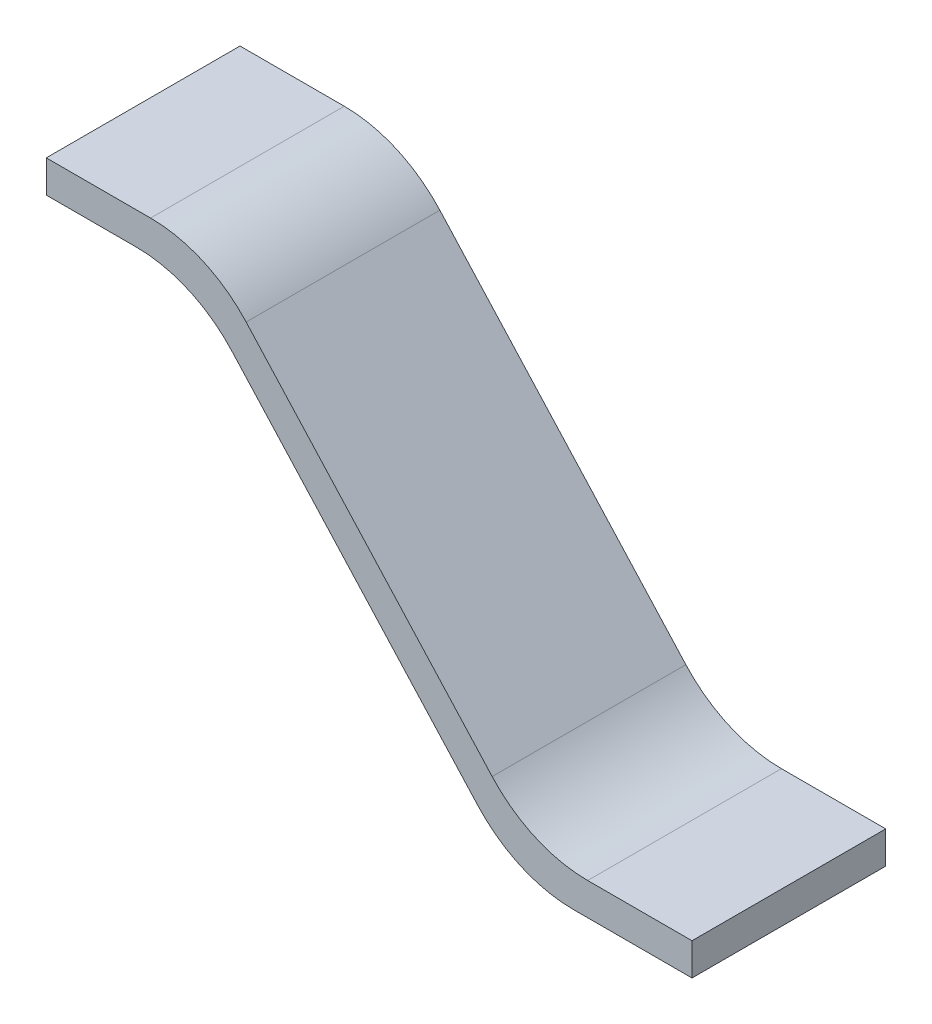
ISO-10303-21;
HEADER;
FILE_DESCRIPTION(('STEP AP214'),'2;1');
FILE_NAME('part.step','',(''),(''),'','','');
FILE_SCHEMA(('AUTOMOTIVE_DESIGN { 1 0 10303 214 1 1 1 1 }'));
ENDSEC;
DATA;
#1=APPLICATION_CONTEXT('core data for automotive mechanical design processes');
#2=APPLICATION_PROTOCOL_DEFINITION('international standard','automotive_design',2000,#1);
#3=PRODUCT_CONTEXT('',#1,'mechanical');
#4=PRODUCT('Part','Part','',(#3));
#5=PRODUCT_RELATED_PRODUCT_CATEGORY('part','',(#4));
#6=PRODUCT_DEFINITION_FORMATION('','',#4);
#7=PRODUCT_DEFINITION_CONTEXT('part definition',#1,'design');
#8=PRODUCT_DEFINITION('design','',#6,#7);
#9=PRODUCT_DEFINITION_SHAPE('','',#8);
#10=(LENGTH_UNIT() NAMED_UNIT(*) SI_UNIT(.MILLI.,.METRE.));
#11=(NAMED_UNIT(*) PLANE_ANGLE_UNIT() SI_UNIT($,.RADIAN.));
#12=(NAMED_UNIT(*) SI_UNIT($,.STERADIAN.) SOLID_ANGLE_UNIT());
#13=UNCERTAINTY_MEASURE_WITH_UNIT(LENGTH_MEASURE(1.E-05),#10,'distance_accuracy_value','');
#14=(GEOMETRIC_REPRESENTATION_CONTEXT(3) GLOBAL_UNCERTAINTY_ASSIGNED_CONTEXT((#13)) GLOBAL_UNIT_ASSIGNED_CONTEXT((#10,
#11,#12)) REPRESENTATION_CONTEXT('',''));
#15=CARTESIAN_POINT('',(0.,0.,0.));
#16=DIRECTION('',(0.,0.,1.));
#17=DIRECTION('',(1.,0.,0.));
#18=AXIS2_PLACEMENT_3D('',#15,#16,#17);
#19=CARTESIAN_POINT('',(0.,-0.05,0.15));
#20=DIRECTION('',(1.,0.,0.));
#21=DIRECTION('',(0.,0.,-1.));
#22=AXIS2_PLACEMENT_3D('',#19,#20,#21);
#23=PLANE('',#22);
#24=DIRECTION('',(0.,-1.,0.));
#25=VECTOR('',#24,1.);
#26=CARTESIAN_POINT('',(0.,-0.05,-0.15));
#27=LINE('',#26,#25);
#28=CARTESIAN_POINT('',(0.,0.,-0.15));
#29=VERTEX_POINT('',#28);
#30=CARTESIAN_POINT('',(0.,-0.05,-0.15));
#31=VERTEX_POINT('',#30);
#32=EDGE_CURVE('E148',#29,#31,#27,.T.);
#33=ORIENTED_EDGE('',*,*,#32,.T.);
#34=DIRECTION('',(0.,0.,-1.));
#35=VECTOR('',#34,1.);
#36=CARTESIAN_POINT('',(0.,-0.05,0.15));
#37=LINE('',#36,#35);
#38=CARTESIAN_POINT('',(0.,-0.05,0.15));
#39=VERTEX_POINT('',#38);
#40=EDGE_CURVE('E130',#39,#31,#37,.T.);
#41=ORIENTED_EDGE('',*,*,#40,.F.);
#42=DIRECTION('',(0.,-1.,0.));
#43=VECTOR('',#42,1.);
#44=CARTESIAN_POINT('',(0.,-0.05,0.15));
#45=LINE('',#44,#43);
#46=CARTESIAN_POINT('',(0.,0.,0.15));
#47=VERTEX_POINT('',#46);
#48=EDGE_CURVE('E136',#47,#39,#45,.T.);
#49=ORIENTED_EDGE('',*,*,#48,.F.);
#50=DIRECTION('',(0.,0.,-1.));
#51=VECTOR('',#50,1.);
#52=CARTESIAN_POINT('',(0.,0.,0.15));
#53=LINE('',#52,#51);
#54=EDGE_CURVE('E210',#47,#29,#53,.T.);
#55=ORIENTED_EDGE('',*,*,#54,.T.);
#56=EDGE_LOOP('',(#33,#41,#49,#55));
#57=FACE_BOUND('',#56,.T.);
#58=ADVANCED_FACE('F35',(#57),#23,.F.);
#59=CARTESIAN_POINT('',(0.,-0.05,0.15));
#60=DIRECTION('',(0.,1.,0.));
#61=DIRECTION('',(0.,0.,1.));
#62=AXIS2_PLACEMENT_3D('',#59,#60,#61);
#63=PLANE('',#62);
#64=DIRECTION('',(1.,0.,0.));
#65=VECTOR('',#64,1.);
#66=CARTESIAN_POINT('',(0.,-0.05,-0.15));
#67=LINE('',#66,#65);
#68=CARTESIAN_POINT('',(0.139407528470034,-0.05,-0.15));
#69=VERTEX_POINT('',#68);
#70=EDGE_CURVE('E217',#31,#69,#67,.T.);
#71=ORIENTED_EDGE('',*,*,#70,.T.);
#72=DIRECTION('',(0.,0.,-1.));
#73=VECTOR('',#72,1.);
#74=CARTESIAN_POINT('',(0.139407528470034,-0.05,0.15));
#75=LINE('',#74,#73);
#76=CARTESIAN_POINT('',(0.139407528470034,-0.05,0.15));
#77=VERTEX_POINT('',#76);
#78=EDGE_CURVE('E133',#69,#77,#75,.F.);
#79=ORIENTED_EDGE('',*,*,#78,.T.);
#80=DIRECTION('',(1.,0.,0.));
#81=VECTOR('',#80,1.);
#82=CARTESIAN_POINT('',(0.,-0.05,0.15));
#83=LINE('',#82,#81);
#84=EDGE_CURVE('E125',#39,#77,#83,.T.);
#85=ORIENTED_EDGE('',*,*,#84,.F.);
#86=ORIENTED_EDGE('',*,*,#40,.T.);
#87=EDGE_LOOP('',(#71,#79,#85,#86));
#88=FACE_BOUND('',#87,.T.);
#89=ADVANCED_FACE('F128',(#88),#63,.F.);
#90=CARTESIAN_POINT('',(0.227881505694007,-0.05,0.15));
#91=DIRECTION('',(0.739940073395944,0.672672793996313,0.));
#92=DIRECTION('',(-0.672672793996313,0.739940073395944,0.));
#93=AXIS2_PLACEMENT_3D('',#90,#91,#92);
#94=PLANE('',#93);
#95=DIRECTION('',(0.672672793996313,-0.739940073395944,0.));
#96=VECTOR('',#95,1.);
#97=CARTESIAN_POINT('',(0.227881505694007,-0.05,0.15));
#98=LINE('',#97,#96);
#99=CARTESIAN_POINT('',(0.287395543149223,-0.115465441200738,0.15));
#100=VERTEX_POINT('',#99);
#101=CARTESIAN_POINT('',(0.668367468238791,-0.534534558799262,0.15));
#102=VERTEX_POINT('',#101);
#103=EDGE_CURVE('E135',#100,#102,#98,.T.);
#104=ORIENTED_EDGE('',*,*,#103,.F.);
#105=DIRECTION('',(0.,0.,-1.));
#106=VECTOR('',#105,1.);
#107=CARTESIAN_POINT('',(0.287395543149223,-0.115465441200738,-0.15));
#108=LINE('',#107,#106);
#109=CARTESIAN_POINT('',(0.287395543149223,-0.115465441200738,-0.15));
#110=VERTEX_POINT('',#109);
#111=EDGE_CURVE('E152',#100,#110,#108,.T.);
#112=ORIENTED_EDGE('',*,*,#111,.T.);
#113=DIRECTION('',(0.672672793996313,-0.739940073395944,0.));
#114=VECTOR('',#113,1.);
#115=CARTESIAN_POINT('',(0.227881505694007,-0.05,-0.15));
#116=LINE('',#115,#114);
#117=CARTESIAN_POINT('',(0.668367468238791,-0.534534558799262,-0.15));
#118=VERTEX_POINT('',#117);
#119=EDGE_CURVE('E219',#110,#118,#116,.T.);
#120=ORIENTED_EDGE('',*,*,#119,.T.);
#121=DIRECTION('',(0.,0.,-1.));
#122=VECTOR('',#121,1.);
#123=CARTESIAN_POINT('',(0.668367468238791,-0.534534558799262,0.15));
#124=LINE('',#123,#122);
#125=EDGE_CURVE('E149',#118,#102,#124,.F.);
#126=ORIENTED_EDGE('',*,*,#125,.T.);
#127=EDGE_LOOP('',(#104,#112,#120,#126));
#128=FACE_BOUND('',#127,.T.);
#129=ADVANCED_FACE('F236',(#128),#94,.F.);
#130=CARTESIAN_POINT('',(0.727881505694007,-0.6,0.15));
#131=DIRECTION('',(0.,1.,0.));
#132=DIRECTION('',(0.,0.,1.));
#133=AXIS2_PLACEMENT_3D('',#130,#131,#132);
#134=PLANE('',#133);
#135=DIRECTION('',(1.,0.,0.));
#136=VECTOR('',#135,1.);
#137=CARTESIAN_POINT('',(0.727881505694007,-0.6,0.15));
#138=LINE('',#137,#136);
#139=CARTESIAN_POINT('',(0.81635548291798,-0.6,0.15));
#140=VERTEX_POINT('',#139);
#141=CARTESIAN_POINT('',(1.,-0.6,0.15));
#142=VERTEX_POINT('',#141);
#143=EDGE_CURVE('E238',#140,#142,#138,.T.);
#144=ORIENTED_EDGE('',*,*,#143,.F.);
#145=DIRECTION('',(0.,0.,-1.));
#146=VECTOR('',#145,1.);
#147=CARTESIAN_POINT('',(0.81635548291798,-0.6,0.15));
#148=LINE('',#147,#146);
#149=CARTESIAN_POINT('',(0.81635548291798,-0.6,-0.15));
#150=VERTEX_POINT('',#149);
#151=EDGE_CURVE('E162',#140,#150,#148,.T.);
#152=ORIENTED_EDGE('',*,*,#151,.T.);
#153=DIRECTION('',(1.,0.,0.));
#154=VECTOR('',#153,1.);
#155=CARTESIAN_POINT('',(0.727881505694007,-0.6,-0.15));
#156=LINE('',#155,#154);
#157=CARTESIAN_POINT('',(1.,-0.6,-0.15));
#158=VERTEX_POINT('',#157);
#159=EDGE_CURVE('E222',#150,#158,#156,.T.);
#160=ORIENTED_EDGE('',*,*,#159,.T.);
#161=DIRECTION('',(0.,0.,-1.));
#162=VECTOR('',#161,1.);
#163=CARTESIAN_POINT('',(1.,-0.6,0.15));
#164=LINE('',#163,#162);
#165=EDGE_CURVE('E150',#142,#158,#164,.T.);
#166=ORIENTED_EDGE('',*,*,#165,.F.);
#167=EDGE_LOOP('',(#144,#152,#160,#166));
#168=FACE_BOUND('',#167,.T.);
#169=ADVANCED_FACE('F247',(#168),#134,.F.);
#170=CARTESIAN_POINT('',(1.,-0.6,0.15));
#171=DIRECTION('',(-1.,0.,0.));
#172=DIRECTION('',(0.,0.,1.));
#173=AXIS2_PLACEMENT_3D('',#170,#171,#172);
#174=PLANE('',#173);
#175=DIRECTION('',(0.,1.,0.));
#176=VECTOR('',#175,1.);
#177=CARTESIAN_POINT('',(1.,-0.6,-0.15));
#178=LINE('',#177,#176);
#179=CARTESIAN_POINT('',(1.,-0.55,-0.15));
#180=VERTEX_POINT('',#179);
#181=EDGE_CURVE('E202',#158,#180,#178,.T.);
#182=ORIENTED_EDGE('',*,*,#181,.T.);
#183=DIRECTION('',(0.,0.,-1.));
#184=VECTOR('',#183,1.);
#185=CARTESIAN_POINT('',(1.,-0.55,0.15));
#186=LINE('',#185,#184);
#187=CARTESIAN_POINT('',(1.,-0.55,0.15));
#188=VERTEX_POINT('',#187);
#189=EDGE_CURVE('E155',#188,#180,#186,.T.);
#190=ORIENTED_EDGE('',*,*,#189,.F.);
#191=DIRECTION('',(0.,1.,0.));
#192=VECTOR('',#191,1.);
#193=CARTESIAN_POINT('',(1.,-0.6,0.15));
#194=LINE('',#193,#192);
#195=EDGE_CURVE('E212',#142,#188,#194,.T.);
#196=ORIENTED_EDGE('',*,*,#195,.F.);
#197=ORIENTED_EDGE('',*,*,#165,.T.);
#198=EDGE_LOOP('',(#182,#190,#196,#197));
#199=FACE_BOUND('',#198,.T.);
#200=ADVANCED_FACE('F245',(#199),#174,.F.);
#201=CARTESIAN_POINT('',(0.75,-0.55,0.15));
#202=DIRECTION('',(0.,-1.,0.));
#203=DIRECTION('',(0.,0.,-1.));
#204=AXIS2_PLACEMENT_3D('',#201,#202,#203);
#205=PLANE('',#204);
#206=DIRECTION('',(-1.,0.,0.));
#207=VECTOR('',#206,1.);
#208=CARTESIAN_POINT('',(0.75,-0.55,-0.15));
#209=LINE('',#208,#207);
#210=CARTESIAN_POINT('',(0.838473977223973,-0.55,-0.15));
#211=VERTEX_POINT('',#210);
#212=EDGE_CURVE('E191',#180,#211,#209,.T.);
#213=ORIENTED_EDGE('',*,*,#212,.T.);
#214=DIRECTION('',(0.,0.,-1.));
#215=VECTOR('',#214,1.);
#216=CARTESIAN_POINT('',(0.838473977223973,-0.55,0.15));
#217=LINE('',#216,#215);
#218=CARTESIAN_POINT('',(0.838473977223973,-0.55,0.15));
#219=VERTEX_POINT('',#218);
#220=EDGE_CURVE('E176',#211,#219,#217,.F.);
#221=ORIENTED_EDGE('',*,*,#220,.T.);
#222=DIRECTION('',(-1.,0.,0.));
#223=VECTOR('',#222,1.);
#224=CARTESIAN_POINT('',(0.75,-0.55,0.15));
#225=LINE('',#224,#223);
#226=EDGE_CURVE('E207',#188,#219,#225,.T.);
#227=ORIENTED_EDGE('',*,*,#226,.F.);
#228=ORIENTED_EDGE('',*,*,#189,.T.);
#229=EDGE_LOOP('',(#213,#221,#227,#228));
#230=FACE_BOUND('',#229,.T.);
#231=ADVANCED_FACE('F198',(#230),#205,.F.);
#232=CARTESIAN_POINT('',(0.25,0.,0.15));
#233=DIRECTION('',(-0.739940073395944,-0.672672793996313,0.));
#234=DIRECTION('',(0.672672793996313,-0.739940073395944,0.));
#235=AXIS2_PLACEMENT_3D('',#232,#233,#234);
#236=PLANE('',#235);
#237=DIRECTION('',(-0.672672793996313,0.739940073395944,0.));
#238=VECTOR('',#237,1.);
#239=CARTESIAN_POINT('',(0.25,0.,0.15));
#240=LINE('',#239,#238);
#241=CARTESIAN_POINT('',(0.690485962544784,-0.484534558799263,0.15));
#242=VERTEX_POINT('',#241);
#243=CARTESIAN_POINT('',(0.309514037455216,-0.0654654412007375,0.15));
#244=VERTEX_POINT('',#243);
#245=EDGE_CURVE('E206',#242,#244,#240,.T.);
#246=ORIENTED_EDGE('',*,*,#245,.F.);
#247=DIRECTION('',(0.,0.,-1.));
#248=VECTOR('',#247,1.);
#249=CARTESIAN_POINT('',(0.690485962544784,-0.484534558799262,-0.15));
#250=LINE('',#249,#248);
#251=CARTESIAN_POINT('',(0.690485962544784,-0.484534558799263,-0.15));
#252=VERTEX_POINT('',#251);
#253=EDGE_CURVE('E173',#242,#252,#250,.T.);
#254=ORIENTED_EDGE('',*,*,#253,.T.);
#255=DIRECTION('',(-0.672672793996313,0.739940073395944,0.));
#256=VECTOR('',#255,1.);
#257=CARTESIAN_POINT('',(0.25,0.,-0.15));
#258=LINE('',#257,#256);
#259=CARTESIAN_POINT('',(0.309514037455216,-0.0654654412007375,-0.15));
#260=VERTEX_POINT('',#259);
#261=EDGE_CURVE('E192',#252,#260,#258,.T.);
#262=ORIENTED_EDGE('',*,*,#261,.T.);
#263=DIRECTION('',(0.,0.,-1.));
#264=VECTOR('',#263,1.);
#265=CARTESIAN_POINT('',(0.309514037455216,-0.0654654412007375,0.15));
#266=LINE('',#265,#264);
#267=EDGE_CURVE('E58',#260,#244,#266,.F.);
#268=ORIENTED_EDGE('',*,*,#267,.T.);
#269=EDGE_LOOP('',(#246,#254,#262,#268));
#270=FACE_BOUND('',#269,.T.);
#271=ADVANCED_FACE('F208',(#270),#236,.F.);
#272=CARTESIAN_POINT('',(0.,0.,0.15));
#273=DIRECTION('',(0.,-1.,0.));
#274=DIRECTION('',(0.,0.,-1.));
#275=AXIS2_PLACEMENT_3D('',#272,#273,#274);
#276=PLANE('',#275);
#277=DIRECTION('',(-1.,0.,0.));
#278=VECTOR('',#277,1.);
#279=CARTESIAN_POINT('',(0.,0.,0.15));
#280=LINE('',#279,#278);
#281=CARTESIAN_POINT('',(0.161526022776027,0.,0.15));
#282=VERTEX_POINT('',#281);
#283=EDGE_CURVE('E141',#282,#47,#280,.T.);
#284=ORIENTED_EDGE('',*,*,#283,.F.);
#285=DIRECTION('',(0.,0.,-1.));
#286=VECTOR('',#285,1.);
#287=CARTESIAN_POINT('',(0.161526022776027,0.,0.15));
#288=LINE('',#287,#286);
#289=CARTESIAN_POINT('',(0.161526022776027,0.,-0.15));
#290=VERTEX_POINT('',#289);
#291=EDGE_CURVE('E178',#282,#290,#288,.T.);
#292=ORIENTED_EDGE('',*,*,#291,.T.);
#293=DIRECTION('',(-1.,0.,0.));
#294=VECTOR('',#293,1.);
#295=CARTESIAN_POINT('',(0.,0.,-0.15));
#296=LINE('',#295,#294);
#297=EDGE_CURVE('E145',#290,#29,#296,.T.);
#298=ORIENTED_EDGE('',*,*,#297,.T.);
#299=ORIENTED_EDGE('',*,*,#54,.F.);
#300=EDGE_LOOP('',(#284,#292,#298,#299));
#301=FACE_BOUND('',#300,.T.);
#302=ADVANCED_FACE('F275',(#301),#276,.F.);
#303=CARTESIAN_POINT('',(0.,0.,0.15));
#304=DIRECTION('',(0.,0.,-1.));
#305=DIRECTION('',(-1.,0.,0.));
#306=AXIS2_PLACEMENT_3D('',#303,#304,#305);
#307=PLANE('',#306);
#308=ORIENTED_EDGE('',*,*,#103,.T.);
#309=CARTESIAN_POINT('',(0.81635548291798,-0.4,0.15));
#310=DIRECTION('',(0.,0.,-1.));
#311=DIRECTION('',(-1.,0.,0.));
#312=AXIS2_PLACEMENT_3D('',#309,#310,#311);
#313=CIRCLE('',#312,0.2);
#314=EDGE_CURVE('E170',#102,#140,#313,.F.);
#315=ORIENTED_EDGE('',*,*,#314,.T.);
#316=ORIENTED_EDGE('',*,*,#143,.T.);
#317=ORIENTED_EDGE('',*,*,#195,.T.);
#318=ORIENTED_EDGE('',*,*,#226,.T.);
#319=CARTESIAN_POINT('',(0.838473977223973,-0.35,0.15));
#320=DIRECTION('',(0.,0.,-1.));
#321=DIRECTION('',(-1.,0.,0.));
#322=AXIS2_PLACEMENT_3D('',#319,#320,#321);
#323=CIRCLE('',#322,0.2);
#324=EDGE_CURVE('E11',#219,#242,#323,.T.);
#325=ORIENTED_EDGE('',*,*,#324,.T.);
#326=ORIENTED_EDGE('',*,*,#245,.T.);
#327=CARTESIAN_POINT('',(0.161526022776027,-0.2,0.15));
#328=DIRECTION('',(0.,0.,-1.));
#329=DIRECTION('',(-1.,0.,0.));
#330=AXIS2_PLACEMENT_3D('',#327,#328,#329);
#331=CIRCLE('',#330,0.2);
#332=EDGE_CURVE('E50',#244,#282,#331,.F.);
#333=ORIENTED_EDGE('',*,*,#332,.T.);
#334=ORIENTED_EDGE('',*,*,#283,.T.);
#335=ORIENTED_EDGE('',*,*,#48,.T.);
#336=ORIENTED_EDGE('',*,*,#84,.T.);
#337=CARTESIAN_POINT('',(0.139407528470034,-0.25,0.15));
#338=DIRECTION('',(0.,0.,-1.));
#339=DIRECTION('',(-1.,0.,0.));
#340=AXIS2_PLACEMENT_3D('',#337,#338,#339);
#341=CIRCLE('',#340,0.2);
#342=EDGE_CURVE('E183',#77,#100,#341,.T.);
#343=ORIENTED_EDGE('',*,*,#342,.T.);
#344=EDGE_LOOP('',(#308,#315,#316,#317,#318,#325,#326,#333,#334,#335,#336,#343));
#345=FACE_BOUND('',#344,.T.);
#346=ADVANCED_FACE('F140',(#345),#307,.F.);
#347=CARTESIAN_POINT('',(0.,0.,-0.15));
#348=DIRECTION('',(0.,0.,-1.));
#349=DIRECTION('',(-1.,0.,0.));
#350=AXIS2_PLACEMENT_3D('',#347,#348,#349);
#351=PLANE('',#350);
#352=ORIENTED_EDGE('',*,*,#159,.F.);
#353=CARTESIAN_POINT('',(0.81635548291798,-0.4,-0.15));
#354=DIRECTION('',(0.,0.,-1.));
#355=DIRECTION('',(-1.,0.,0.));
#356=AXIS2_PLACEMENT_3D('',#353,#354,#355);
#357=CIRCLE('',#356,0.2);
#358=EDGE_CURVE('E167',#150,#118,#357,.T.);
#359=ORIENTED_EDGE('',*,*,#358,.T.);
#360=ORIENTED_EDGE('',*,*,#119,.F.);
#361=CARTESIAN_POINT('',(0.139407528470034,-0.25,-0.15));
#362=DIRECTION('',(0.,0.,-1.));
#363=DIRECTION('',(-1.,0.,0.));
#364=AXIS2_PLACEMENT_3D('',#361,#362,#363);
#365=CIRCLE('',#364,0.2);
#366=EDGE_CURVE('E181',#110,#69,#365,.F.);
#367=ORIENTED_EDGE('',*,*,#366,.T.);
#368=ORIENTED_EDGE('',*,*,#70,.F.);
#369=ORIENTED_EDGE('',*,*,#32,.F.);
#370=ORIENTED_EDGE('',*,*,#297,.F.);
#371=CARTESIAN_POINT('',(0.161526022776027,-0.2,-0.15));
#372=DIRECTION('',(0.,0.,-1.));
#373=DIRECTION('',(-1.,0.,0.));
#374=AXIS2_PLACEMENT_3D('',#371,#372,#373);
#375=CIRCLE('',#374,0.2);
#376=EDGE_CURVE('E165',#290,#260,#375,.T.);
#377=ORIENTED_EDGE('',*,*,#376,.T.);
#378=ORIENTED_EDGE('',*,*,#261,.F.);
#379=CARTESIAN_POINT('',(0.838473977223973,-0.35,-0.15));
#380=DIRECTION('',(0.,0.,-1.));
#381=DIRECTION('',(-1.,0.,0.));
#382=AXIS2_PLACEMENT_3D('',#379,#380,#381);
#383=CIRCLE('',#382,0.2);
#384=EDGE_CURVE('E43',#252,#211,#383,.F.);
#385=ORIENTED_EDGE('',*,*,#384,.T.);
#386=ORIENTED_EDGE('',*,*,#212,.F.);
#387=ORIENTED_EDGE('',*,*,#181,.F.);
#388=EDGE_LOOP('',(#352,#359,#360,#367,#368,#369,#370,#377,#378,#385,#386,#387));
#389=FACE_BOUND('',#388,.T.);
#390=ADVANCED_FACE('F189',(#389),#351,.T.);
#391=CARTESIAN_POINT('',(0.139407528470034,-0.25,0.15));
#392=DIRECTION('',(0.,0.,1.));
#393=DIRECTION('',(1.,0.,0.));
#394=AXIS2_PLACEMENT_3D('',#391,#392,#393);
#395=CYLINDRICAL_SURFACE('',#394,0.2);
#396=ORIENTED_EDGE('',*,*,#342,.F.);
#397=ORIENTED_EDGE('',*,*,#78,.F.);
#398=ORIENTED_EDGE('',*,*,#366,.F.);
#399=ORIENTED_EDGE('',*,*,#111,.F.);
#400=EDGE_LOOP('',(#396,#397,#398,#399));
#401=FACE_BOUND('',#400,.T.);
#402=ADVANCED_FACE('F231',(#401),#395,.F.);
#403=CARTESIAN_POINT('',(0.81635548291798,-0.4,0.15));
#404=DIRECTION('',(0.,0.,-1.));
#405=DIRECTION('',(-1.,0.,0.));
#406=AXIS2_PLACEMENT_3D('',#403,#404,#405);
#407=CYLINDRICAL_SURFACE('',#406,0.2);
#408=ORIENTED_EDGE('',*,*,#314,.F.);
#409=ORIENTED_EDGE('',*,*,#125,.F.);
#410=ORIENTED_EDGE('',*,*,#358,.F.);
#411=ORIENTED_EDGE('',*,*,#151,.F.);
#412=EDGE_LOOP('',(#408,#409,#410,#411));
#413=FACE_BOUND('',#412,.T.);
#414=ADVANCED_FACE('F250',(#413),#407,.T.);
#415=CARTESIAN_POINT('',(0.838473977223973,-0.35,0.15));
#416=DIRECTION('',(0.,0.,1.));
#417=DIRECTION('',(1.,0.,0.));
#418=AXIS2_PLACEMENT_3D('',#415,#416,#417);
#419=CYLINDRICAL_SURFACE('',#418,0.2);
#420=ORIENTED_EDGE('',*,*,#324,.F.);
#421=ORIENTED_EDGE('',*,*,#220,.F.);
#422=ORIENTED_EDGE('',*,*,#384,.F.);
#423=ORIENTED_EDGE('',*,*,#253,.F.);
#424=EDGE_LOOP('',(#420,#421,#422,#423));
#425=FACE_BOUND('',#424,.T.);
#426=ADVANCED_FACE('F205',(#425),#419,.F.);
#427=CARTESIAN_POINT('',(0.161526022776027,-0.2,0.15));
#428=DIRECTION('',(0.,0.,-1.));
#429=DIRECTION('',(-1.,0.,0.));
#430=AXIS2_PLACEMENT_3D('',#427,#428,#429);
#431=CYLINDRICAL_SURFACE('',#430,0.2);
#432=ORIENTED_EDGE('',*,*,#332,.F.);
#433=ORIENTED_EDGE('',*,*,#267,.F.);
#434=ORIENTED_EDGE('',*,*,#376,.F.);
#435=ORIENTED_EDGE('',*,*,#291,.F.);
#436=EDGE_LOOP('',(#432,#433,#434,#435));
#437=FACE_BOUND('',#436,.T.);
#438=ADVANCED_FACE('F37',(#437),#431,.T.);
#439=CLOSED_SHELL('',(#58,#89,#129,#169,#200,#231,#271,#302,#346,#390,#402,#414,#426,#438));
#440=MANIFOLD_SOLID_BREP('B2',#439);
#441=ADVANCED_BREP_SHAPE_REPRESENTATION('',(#18,#440),#14);
#442=SHAPE_DEFINITION_REPRESENTATION(#9,#441);
ENDSEC;
END-ISO-10303-21;
